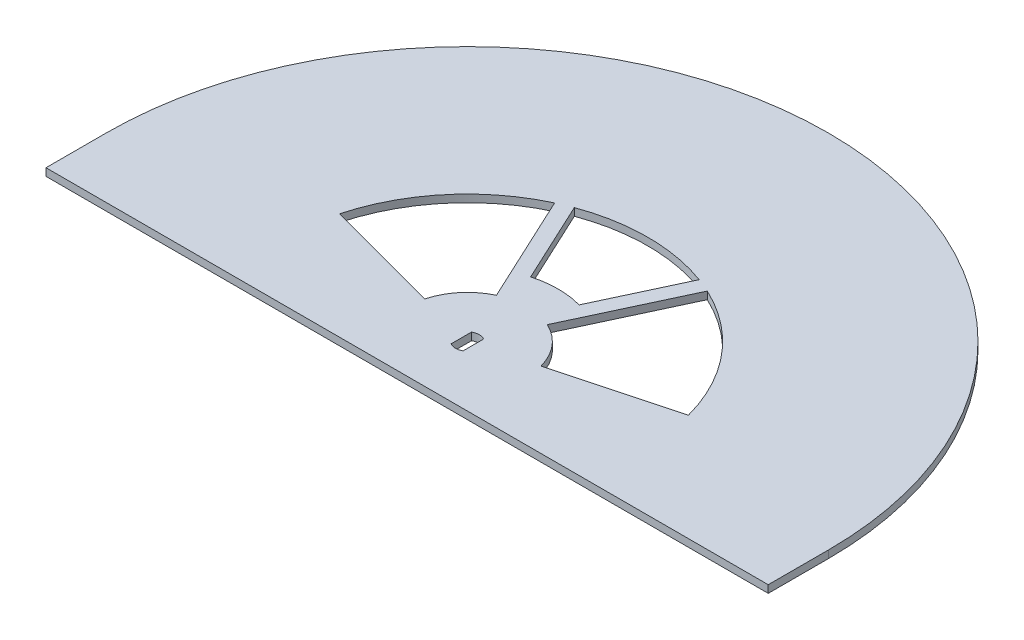
ISO-10303-21;
HEADER;
FILE_DESCRIPTION(('STEP AP214'),'2;1');
FILE_NAME('part.step','',(''),(''),'','','');
FILE_SCHEMA(('AUTOMOTIVE_DESIGN { 1 0 10303 214 1 1 1 1 }'));
ENDSEC;
DATA;
#1=APPLICATION_CONTEXT('core data for automotive mechanical design processes');
#2=APPLICATION_PROTOCOL_DEFINITION('international standard','automotive_design',2000,#1);
#3=PRODUCT_CONTEXT('',#1,'mechanical');
#4=PRODUCT('Part','Part','',(#3));
#5=PRODUCT_RELATED_PRODUCT_CATEGORY('part','',(#4));
#6=PRODUCT_DEFINITION_FORMATION('','',#4);
#7=PRODUCT_DEFINITION_CONTEXT('part definition',#1,'design');
#8=PRODUCT_DEFINITION('design','',#6,#7);
#9=PRODUCT_DEFINITION_SHAPE('','',#8);
#10=(LENGTH_UNIT() NAMED_UNIT(*) SI_UNIT(.MILLI.,.METRE.));
#11=(NAMED_UNIT(*) PLANE_ANGLE_UNIT() SI_UNIT($,.RADIAN.));
#12=(NAMED_UNIT(*) SI_UNIT($,.STERADIAN.) SOLID_ANGLE_UNIT());
#13=UNCERTAINTY_MEASURE_WITH_UNIT(LENGTH_MEASURE(1.E-05),#10,'distance_accuracy_value','');
#14=(GEOMETRIC_REPRESENTATION_CONTEXT(3) GLOBAL_UNCERTAINTY_ASSIGNED_CONTEXT((#13)) GLOBAL_UNIT_ASSIGNED_CONTEXT((#10,
#11,#12)) REPRESENTATION_CONTEXT('',''));
#15=CARTESIAN_POINT('',(0.,0.,0.));
#16=DIRECTION('',(0.,0.,1.));
#17=DIRECTION('',(1.,0.,0.));
#18=AXIS2_PLACEMENT_3D('',#15,#16,#17);
#19=CARTESIAN_POINT('',(0.,1.5875,0.));
#20=DIRECTION('',(0.,1.,0.));
#21=DIRECTION('',(0.,0.,1.));
#22=AXIS2_PLACEMENT_3D('',#19,#20,#21);
#23=PLANE('',#22);
#24=CARTESIAN_POINT('',(0.,1.5875,0.));
#25=DIRECTION('',(0.,1.,0.));
#26=DIRECTION('',(0.,0.,1.));
#27=AXIS2_PLACEMENT_3D('',#24,#25,#26);
#28=CIRCLE('',#27,2.5);
#29=CARTESIAN_POINT('',(1.27573508221731,1.5875,-2.15));
#30=VERTEX_POINT('',#29);
#31=CARTESIAN_POINT('',(-1.27573508221731,1.5875,-2.15));
#32=VERTEX_POINT('',#31);
#33=EDGE_CURVE('E50',#30,#32,#28,.T.);
#34=ORIENTED_EDGE('',*,*,#33,.F.);
#35=DIRECTION('',(0.,0.,-1.));
#36=VECTOR('',#35,1.);
#37=CARTESIAN_POINT('',(1.27573508221731,1.5875,-2.15));
#38=LINE('',#37,#36);
#39=CARTESIAN_POINT('',(1.27573508221731,1.5875,2.15));
#40=VERTEX_POINT('',#39);
#41=EDGE_CURVE('E189',#40,#30,#38,.T.);
#42=ORIENTED_EDGE('',*,*,#41,.F.);
#43=CARTESIAN_POINT('',(0.,1.5875,0.));
#44=DIRECTION('',(0.,1.,0.));
#45=DIRECTION('',(0.,0.,1.));
#46=AXIS2_PLACEMENT_3D('',#43,#44,#45);
#47=CIRCLE('',#46,2.5);
#48=CARTESIAN_POINT('',(-1.27573508221731,1.5875,2.15));
#49=VERTEX_POINT('',#48);
#50=EDGE_CURVE('E192',#49,#40,#47,.T.);
#51=ORIENTED_EDGE('',*,*,#50,.F.);
#52=DIRECTION('',(0.,0.,1.));
#53=VECTOR('',#52,1.);
#54=CARTESIAN_POINT('',(-1.27573508221731,1.5875,-2.15));
#55=LINE('',#54,#53);
#56=EDGE_CURVE('E198',#32,#49,#55,.T.);
#57=ORIENTED_EDGE('',*,*,#56,.F.);
#58=EDGE_LOOP('',(#34,#42,#51,#57));
#59=FACE_BOUND('',#58,.T.);
#60=CARTESIAN_POINT('',(0.,1.5875,0.));
#61=DIRECTION('',(0.,1.,0.));
#62=DIRECTION('',(0.,0.,1.));
#63=AXIS2_PLACEMENT_3D('',#60,#61,#62);
#64=CIRCLE('',#63,76.2);
#65=CARTESIAN_POINT('',(76.2,1.5875,0.));
#66=VERTEX_POINT('',#65);
#67=CARTESIAN_POINT('',(-76.2,1.5875,0.));
#68=VERTEX_POINT('',#67);
#69=EDGE_CURVE('E321',#66,#68,#64,.T.);
#70=ORIENTED_EDGE('',*,*,#69,.T.);
#71=DIRECTION('',(0.,0.,1.));
#72=VECTOR('',#71,1.);
#73=CARTESIAN_POINT('',(-76.2,1.5875,0.));
#74=LINE('',#73,#72);
#75=CARTESIAN_POINT('',(-76.2,1.5875,12.7));
#76=VERTEX_POINT('',#75);
#77=EDGE_CURVE('E204',#68,#76,#74,.T.);
#78=ORIENTED_EDGE('',*,*,#77,.T.);
#79=DIRECTION('',(1.,0.,0.));
#80=VECTOR('',#79,1.);
#81=CARTESIAN_POINT('',(-76.2,1.5875,12.7));
#82=LINE('',#81,#80);
#83=CARTESIAN_POINT('',(76.2,1.5875,12.7));
#84=VERTEX_POINT('',#83);
#85=EDGE_CURVE('E220',#76,#84,#82,.T.);
#86=ORIENTED_EDGE('',*,*,#85,.T.);
#87=DIRECTION('',(0.,0.,-1.));
#88=VECTOR('',#87,1.);
#89=CARTESIAN_POINT('',(76.2,1.5875,0.));
#90=LINE('',#89,#88);
#91=EDGE_CURVE('E212',#84,#66,#90,.T.);
#92=ORIENTED_EDGE('',*,*,#91,.T.);
#93=EDGE_LOOP('',(#70,#78,#86,#92));
#94=FACE_BOUND('',#93,.T.);
#95=DIRECTION('',(-0.422618261743583,0.,-0.906307787035306));
#96=VECTOR('',#95,1.);
#97=CARTESIAN_POINT('',(-16.1017557724588,1.5875,-34.5303266860319));
#98=LINE('',#97,#96);
#99=CARTESIAN_POINT('',(-5.36725192413684,1.5875,-11.5101088952602));
#100=VERTEX_POINT('',#99);
#101=CARTESIAN_POINT('',(-16.1017557724588,1.5875,-34.5303266860319));
#102=VERTEX_POINT('',#101);
#103=EDGE_CURVE('E292',#100,#102,#98,.T.);
#104=ORIENTED_EDGE('',*,*,#103,.F.);
#105=CARTESIAN_POINT('',(0.,1.5875,0.));
#106=DIRECTION('',(0.,-1.,0.));
#107=DIRECTION('',(0.,0.,-1.));
#108=AXIS2_PLACEMENT_3D('',#105,#106,#107);
#109=CIRCLE('',#108,12.699999999901);
#110=CARTESIAN_POINT('',(-12.2672579937825,1.5875,-3.28700187268744));
#111=VERTEX_POINT('',#110);
#112=EDGE_CURVE('E290',#111,#100,#109,.T.);
#113=ORIENTED_EDGE('',*,*,#112,.F.);
#114=DIRECTION('',(0.965925826289434,0.,0.258819045101154));
#115=VECTOR('',#114,1.);
#116=CARTESIAN_POINT('',(-12.2672579937825,1.5875,-3.28700187268744));
#117=LINE('',#116,#115);
#118=CARTESIAN_POINT('',(-36.8017739816455,1.5875,-9.8610056182866));
#119=VERTEX_POINT('',#118);
#120=EDGE_CURVE('E298',#119,#111,#117,.T.);
#121=ORIENTED_EDGE('',*,*,#120,.F.);
#122=CARTESIAN_POINT('',(0.,1.5875,0.));
#123=DIRECTION('',(0.,1.,0.));
#124=DIRECTION('',(0.,0.,-1.));
#125=AXIS2_PLACEMENT_3D('',#122,#123,#124);
#126=CIRCLE('',#125,38.1);
#127=EDGE_CURVE('E295',#102,#119,#126,.T.);
#128=ORIENTED_EDGE('',*,*,#127,.F.);
#129=EDGE_LOOP('',(#104,#113,#121,#128));
#130=FACE_BOUND('',#129,.T.);
#131=DIRECTION('',(0.422618261743582,0.,0.906307787035306));
#132=VECTOR('',#131,1.);
#133=CARTESIAN_POINT('',(-13.1682222718977,1.5875,-35.7520338190421));
#134=LINE('',#133,#132);
#135=CARTESIAN_POINT('',(-13.1682222718977,1.5875,-35.7520338190421));
#136=VERTEX_POINT('',#135);
#137=CARTESIAN_POINT('',(-5.11734438568244,1.5875,-18.4868704760196));
#138=VERTEX_POINT('',#137);
#139=EDGE_CURVE('E261',#136,#138,#134,.T.);
#140=ORIENTED_EDGE('',*,*,#139,.F.);
#141=CARTESIAN_POINT('',(-3.84946970807113E-11,1.5875,-8.25571218872692E-11));
#142=DIRECTION('',(0.,1.,0.));
#143=DIRECTION('',(0.,0.,-1.));
#144=AXIS2_PLACEMENT_3D('',#141,#142,#143);
#145=CIRCLE('',#144,38.0999999999097);
#146=CARTESIAN_POINT('',(13.1682222716843,1.5875,-35.7520338190923));
#147=VERTEX_POINT('',#146);
#148=EDGE_CURVE('E259',#147,#136,#145,.T.);
#149=ORIENTED_EDGE('',*,*,#148,.F.);
#150=DIRECTION('',(0.422618261739206,0.,-0.906307787037346));
#151=VECTOR('',#150,1.);
#152=CARTESIAN_POINT('',(13.1682222716843,1.5875,-35.7520338190923));
#153=LINE('',#152,#151);
#154=CARTESIAN_POINT('',(5.11734438556264,1.5875,-18.4868704760527));
#155=VERTEX_POINT('',#154);
#156=EDGE_CURVE('E267',#155,#147,#153,.T.);
#157=ORIENTED_EDGE('',*,*,#156,.F.);
#158=CARTESIAN_POINT('',(0.,1.5875,0.));
#159=DIRECTION('',(0.,-1.,0.));
#160=DIRECTION('',(0.,0.,-1.));
#161=AXIS2_PLACEMENT_3D('',#158,#159,#160);
#162=CIRCLE('',#161,19.1820643716676);
#163=EDGE_CURVE('E264',#138,#155,#162,.T.);
#164=ORIENTED_EDGE('',*,*,#163,.F.);
#165=EDGE_LOOP('',(#140,#149,#157,#164));
#166=FACE_BOUND('',#165,.T.);
#167=DIRECTION('',(0.965925826287314,0.,-0.258819045109067));
#168=VECTOR('',#167,1.);
#169=CARTESIAN_POINT('',(36.8017739815386,1.5875,-9.86100561868564));
#170=LINE('',#169,#168);
#171=CARTESIAN_POINT('',(12.2672579937609,1.5875,-3.28700187289392));
#172=VERTEX_POINT('',#171);
#173=CARTESIAN_POINT('',(36.8017739815386,1.5875,-9.86100561868565));
#174=VERTEX_POINT('',#173);
#175=EDGE_CURVE('E230',#172,#174,#170,.T.);
#176=ORIENTED_EDGE('',*,*,#175,.F.);
#177=CARTESIAN_POINT('',(0.,1.5875,0.));
#178=DIRECTION('',(0.,-1.,0.));
#179=DIRECTION('',(0.,0.,-1.));
#180=AXIS2_PLACEMENT_3D('',#177,#178,#179);
#181=CIRCLE('',#180,12.699999999901);
#182=CARTESIAN_POINT('',(5.36725192393726,1.5875,-11.5101088953173));
#183=VERTEX_POINT('',#182);
#184=EDGE_CURVE('E228',#183,#172,#181,.T.);
#185=ORIENTED_EDGE('',*,*,#184,.F.);
#186=DIRECTION('',(-0.422618261736158,0.,0.906307787038768));
#187=VECTOR('',#186,1.);
#188=CARTESIAN_POINT('',(5.36725192393726,1.5875,-11.5101088953173));
#189=LINE('',#188,#187);
#190=CARTESIAN_POINT('',(16.1017557720844,1.5875,-34.5303266862065));
#191=VERTEX_POINT('',#190);
#192=EDGE_CURVE('E236',#191,#183,#189,.T.);
#193=ORIENTED_EDGE('',*,*,#192,.F.);
#194=CARTESIAN_POINT('',(0.,1.5875,0.));
#195=DIRECTION('',(0.,1.,0.));
#196=DIRECTION('',(0.,0.,-1.));
#197=AXIS2_PLACEMENT_3D('',#194,#195,#196);
#198=CIRCLE('',#197,38.1);
#199=EDGE_CURVE('E233',#174,#191,#198,.T.);
#200=ORIENTED_EDGE('',*,*,#199,.F.);
#201=EDGE_LOOP('',(#176,#185,#193,#200));
#202=FACE_BOUND('',#201,.T.);
#203=ADVANCED_FACE('F35',(#59,#94,#130,#166,#202),#23,.T.);
#204=CARTESIAN_POINT('',(0.,0.,0.));
#205=DIRECTION('',(0.,1.,0.));
#206=DIRECTION('',(0.,0.,1.));
#207=AXIS2_PLACEMENT_3D('',#204,#205,#206);
#208=PLANE('',#207);
#209=DIRECTION('',(0.,0.,-1.));
#210=VECTOR('',#209,1.);
#211=CARTESIAN_POINT('',(1.27573508221731,0.,-2.15));
#212=LINE('',#211,#210);
#213=CARTESIAN_POINT('',(1.27573508221731,0.,2.15));
#214=VERTEX_POINT('',#213);
#215=CARTESIAN_POINT('',(1.27573508221731,0.,-2.15));
#216=VERTEX_POINT('',#215);
#217=EDGE_CURVE('E179',#214,#216,#212,.T.);
#218=ORIENTED_EDGE('',*,*,#217,.T.);
#219=CARTESIAN_POINT('',(0.,0.,0.));
#220=DIRECTION('',(0.,1.,0.));
#221=DIRECTION('',(0.,0.,1.));
#222=AXIS2_PLACEMENT_3D('',#219,#220,#221);
#223=CIRCLE('',#222,2.5);
#224=CARTESIAN_POINT('',(-1.27573508221731,0.,-2.15));
#225=VERTEX_POINT('',#224);
#226=EDGE_CURVE('E173',#216,#225,#223,.T.);
#227=ORIENTED_EDGE('',*,*,#226,.T.);
#228=DIRECTION('',(0.,0.,1.));
#229=VECTOR('',#228,1.);
#230=CARTESIAN_POINT('',(-1.27573508221731,0.,-2.15));
#231=LINE('',#230,#229);
#232=CARTESIAN_POINT('',(-1.27573508221731,0.,2.15));
#233=VERTEX_POINT('',#232);
#234=EDGE_CURVE('E182',#225,#233,#231,.T.);
#235=ORIENTED_EDGE('',*,*,#234,.T.);
#236=CARTESIAN_POINT('',(0.,0.,0.));
#237=DIRECTION('',(0.,1.,0.));
#238=DIRECTION('',(0.,0.,1.));
#239=AXIS2_PLACEMENT_3D('',#236,#237,#238);
#240=CIRCLE('',#239,2.5);
#241=EDGE_CURVE('E58',#233,#214,#240,.T.);
#242=ORIENTED_EDGE('',*,*,#241,.T.);
#243=EDGE_LOOP('',(#218,#227,#235,#242));
#244=FACE_BOUND('',#243,.T.);
#245=CARTESIAN_POINT('',(-3.84946970807113E-11,0.,-8.25571218872692E-11));
#246=DIRECTION('',(0.,1.,0.));
#247=DIRECTION('',(0.,0.,-1.));
#248=AXIS2_PLACEMENT_3D('',#245,#246,#247);
#249=CIRCLE('',#248,38.0999999999097);
#250=CARTESIAN_POINT('',(13.1682222716843,0.,-35.7520338190923));
#251=VERTEX_POINT('',#250);
#252=CARTESIAN_POINT('',(-13.1682222718977,0.,-35.7520338190421));
#253=VERTEX_POINT('',#252);
#254=EDGE_CURVE('E258',#251,#253,#249,.T.);
#255=ORIENTED_EDGE('',*,*,#254,.T.);
#256=DIRECTION('',(0.422618261743582,0.,0.906307787035306));
#257=VECTOR('',#256,1.);
#258=CARTESIAN_POINT('',(-13.1682222718977,0.,-35.7520338190421));
#259=LINE('',#258,#257);
#260=CARTESIAN_POINT('',(-5.11734438568244,0.,-18.4868704760196));
#261=VERTEX_POINT('',#260);
#262=EDGE_CURVE('E272',#253,#261,#259,.T.);
#263=ORIENTED_EDGE('',*,*,#262,.T.);
#264=CARTESIAN_POINT('',(0.,0.,0.));
#265=DIRECTION('',(0.,-1.,0.));
#266=DIRECTION('',(0.,0.,-1.));
#267=AXIS2_PLACEMENT_3D('',#264,#265,#266);
#268=CIRCLE('',#267,19.1820643716676);
#269=CARTESIAN_POINT('',(5.11734438556265,0.,-18.4868704760527));
#270=VERTEX_POINT('',#269);
#271=EDGE_CURVE('E275',#261,#270,#268,.T.);
#272=ORIENTED_EDGE('',*,*,#271,.T.);
#273=DIRECTION('',(0.422618261739206,0.,-0.906307787037346));
#274=VECTOR('',#273,1.);
#275=CARTESIAN_POINT('',(13.1682222716843,0.,-35.7520338190923));
#276=LINE('',#275,#274);
#277=EDGE_CURVE('E262',#270,#251,#276,.T.);
#278=ORIENTED_EDGE('',*,*,#277,.T.);
#279=EDGE_LOOP('',(#255,#263,#272,#278));
#280=FACE_BOUND('',#279,.T.);
#281=CARTESIAN_POINT('',(0.,0.,0.));
#282=DIRECTION('',(0.,1.,0.));
#283=DIRECTION('',(0.,0.,1.));
#284=AXIS2_PLACEMENT_3D('',#281,#282,#283);
#285=CIRCLE('',#284,76.2);
#286=CARTESIAN_POINT('',(76.2,0.,0.));
#287=VERTEX_POINT('',#286);
#288=CARTESIAN_POINT('',(-76.2,0.,0.));
#289=VERTEX_POINT('',#288);
#290=EDGE_CURVE('E320',#287,#289,#285,.T.);
#291=ORIENTED_EDGE('',*,*,#290,.F.);
#292=DIRECTION('',(0.,0.,-1.));
#293=VECTOR('',#292,1.);
#294=CARTESIAN_POINT('',(76.2,0.,0.));
#295=LINE('',#294,#293);
#296=CARTESIAN_POINT('',(76.2,0.,12.7));
#297=VERTEX_POINT('',#296);
#298=EDGE_CURVE('E215',#297,#287,#295,.T.);
#299=ORIENTED_EDGE('',*,*,#298,.F.);
#300=DIRECTION('',(1.,0.,0.));
#301=VECTOR('',#300,1.);
#302=CARTESIAN_POINT('',(-76.2,0.,12.7));
#303=LINE('',#302,#301);
#304=CARTESIAN_POINT('',(-76.2,0.,12.7));
#305=VERTEX_POINT('',#304);
#306=EDGE_CURVE('E211',#305,#297,#303,.T.);
#307=ORIENTED_EDGE('',*,*,#306,.F.);
#308=DIRECTION('',(0.,0.,1.));
#309=VECTOR('',#308,1.);
#310=CARTESIAN_POINT('',(-76.2,0.,0.));
#311=LINE('',#310,#309);
#312=EDGE_CURVE('E208',#289,#305,#311,.T.);
#313=ORIENTED_EDGE('',*,*,#312,.F.);
#314=EDGE_LOOP('',(#291,#299,#307,#313));
#315=FACE_BOUND('',#314,.T.);
#316=CARTESIAN_POINT('',(0.,0.,0.));
#317=DIRECTION('',(0.,-1.,0.));
#318=DIRECTION('',(0.,0.,-1.));
#319=AXIS2_PLACEMENT_3D('',#316,#317,#318);
#320=CIRCLE('',#319,12.699999999901);
#321=CARTESIAN_POINT('',(-12.2672579937825,0.,-3.28700187268744));
#322=VERTEX_POINT('',#321);
#323=CARTESIAN_POINT('',(-5.36725192413684,0.,-11.5101088952602));
#324=VERTEX_POINT('',#323);
#325=EDGE_CURVE('E289',#322,#324,#320,.T.);
#326=ORIENTED_EDGE('',*,*,#325,.T.);
#327=DIRECTION('',(-0.422618261743583,0.,-0.906307787035306));
#328=VECTOR('',#327,1.);
#329=CARTESIAN_POINT('',(-16.1017557724588,0.,-34.5303266860319));
#330=LINE('',#329,#328);
#331=CARTESIAN_POINT('',(-16.1017557724588,0.,-34.5303266860319));
#332=VERTEX_POINT('',#331);
#333=EDGE_CURVE('E303',#324,#332,#330,.T.);
#334=ORIENTED_EDGE('',*,*,#333,.T.);
#335=CARTESIAN_POINT('',(0.,0.,0.));
#336=DIRECTION('',(0.,1.,0.));
#337=DIRECTION('',(0.,0.,-1.));
#338=AXIS2_PLACEMENT_3D('',#335,#336,#337);
#339=CIRCLE('',#338,38.1);
#340=CARTESIAN_POINT('',(-36.8017739816455,0.,-9.8610056182866));
#341=VERTEX_POINT('',#340);
#342=EDGE_CURVE('E306',#332,#341,#339,.T.);
#343=ORIENTED_EDGE('',*,*,#342,.T.);
#344=DIRECTION('',(0.965925826289434,0.,0.258819045101154));
#345=VECTOR('',#344,1.);
#346=CARTESIAN_POINT('',(-12.2672579937825,0.,-3.28700187268744));
#347=LINE('',#346,#345);
#348=EDGE_CURVE('E293',#341,#322,#347,.T.);
#349=ORIENTED_EDGE('',*,*,#348,.T.);
#350=EDGE_LOOP('',(#326,#334,#343,#349));
#351=FACE_BOUND('',#350,.T.);
#352=CARTESIAN_POINT('',(0.,0.,0.));
#353=DIRECTION('',(0.,-1.,0.));
#354=DIRECTION('',(0.,0.,-1.));
#355=AXIS2_PLACEMENT_3D('',#352,#353,#354);
#356=CIRCLE('',#355,12.699999999901);
#357=CARTESIAN_POINT('',(5.36725192393726,0.,-11.5101088953173));
#358=VERTEX_POINT('',#357);
#359=CARTESIAN_POINT('',(12.2672579937609,0.,-3.28700187289392));
#360=VERTEX_POINT('',#359);
#361=EDGE_CURVE('E226',#358,#360,#356,.T.);
#362=ORIENTED_EDGE('',*,*,#361,.T.);
#363=DIRECTION('',(0.965925826287314,0.,-0.258819045109067));
#364=VECTOR('',#363,1.);
#365=CARTESIAN_POINT('',(36.8017739815386,0.,-9.86100561868564));
#366=LINE('',#365,#364);
#367=CARTESIAN_POINT('',(36.8017739815386,0.,-9.86100561868565));
#368=VERTEX_POINT('',#367);
#369=EDGE_CURVE('E241',#360,#368,#366,.T.);
#370=ORIENTED_EDGE('',*,*,#369,.T.);
#371=CARTESIAN_POINT('',(0.,0.,0.));
#372=DIRECTION('',(0.,1.,0.));
#373=DIRECTION('',(0.,0.,-1.));
#374=AXIS2_PLACEMENT_3D('',#371,#372,#373);
#375=CIRCLE('',#374,38.1);
#376=CARTESIAN_POINT('',(16.1017557720844,0.,-34.5303266862065));
#377=VERTEX_POINT('',#376);
#378=EDGE_CURVE('E244',#368,#377,#375,.T.);
#379=ORIENTED_EDGE('',*,*,#378,.T.);
#380=DIRECTION('',(-0.422618261736158,0.,0.906307787038768));
#381=VECTOR('',#380,1.);
#382=CARTESIAN_POINT('',(5.36725192393726,0.,-11.5101088953173));
#383=LINE('',#382,#381);
#384=EDGE_CURVE('E231',#377,#358,#383,.T.);
#385=ORIENTED_EDGE('',*,*,#384,.T.);
#386=EDGE_LOOP('',(#362,#370,#379,#385));
#387=FACE_BOUND('',#386,.T.);
#388=ADVANCED_FACE('F186',(#244,#280,#315,#351,#387),#208,.F.);
#389=CARTESIAN_POINT('',(0.,1.5875,0.));
#390=DIRECTION('',(0.,-1.,0.));
#391=DIRECTION('',(0.,0.,-1.));
#392=AXIS2_PLACEMENT_3D('',#389,#390,#391);
#393=CYLINDRICAL_SURFACE('',#392,76.2);
#394=ORIENTED_EDGE('',*,*,#290,.T.);
#395=DIRECTION('',(0.,-1.,0.));
#396=VECTOR('',#395,1.);
#397=CARTESIAN_POINT('',(-76.2,1.5875,0.));
#398=LINE('',#397,#396);
#399=EDGE_CURVE('E11',#68,#289,#398,.T.);
#400=ORIENTED_EDGE('',*,*,#399,.F.);
#401=ORIENTED_EDGE('',*,*,#69,.F.);
#402=DIRECTION('',(0.,-1.,0.));
#403=VECTOR('',#402,1.);
#404=CARTESIAN_POINT('',(76.2,1.5875,0.));
#405=LINE('',#404,#403);
#406=EDGE_CURVE('E43',#66,#287,#405,.T.);
#407=ORIENTED_EDGE('',*,*,#406,.T.);
#408=EDGE_LOOP('',(#394,#400,#401,#407));
#409=FACE_BOUND('',#408,.T.);
#410=ADVANCED_FACE('F37',(#409),#393,.T.);
#411=CARTESIAN_POINT('',(0.,1.5875,0.));
#412=DIRECTION('',(0.,-1.,0.));
#413=DIRECTION('',(0.,0.,-1.));
#414=AXIS2_PLACEMENT_3D('',#411,#412,#413);
#415=CYLINDRICAL_SURFACE('',#414,12.699999999901);
#416=ORIENTED_EDGE('',*,*,#325,.F.);
#417=DIRECTION('',(0.,-1.,0.));
#418=VECTOR('',#417,1.);
#419=CARTESIAN_POINT('',(-12.2672579937825,1.5875,-3.28700187268744));
#420=LINE('',#419,#418);
#421=EDGE_CURVE('E300',#111,#322,#420,.T.);
#422=ORIENTED_EDGE('',*,*,#421,.F.);
#423=ORIENTED_EDGE('',*,*,#112,.T.);
#424=DIRECTION('',(0.,-1.,0.));
#425=VECTOR('',#424,1.);
#426=CARTESIAN_POINT('',(-5.36725192413684,1.5875,-11.5101088952602));
#427=LINE('',#426,#425);
#428=EDGE_CURVE('E317',#100,#324,#427,.T.);
#429=ORIENTED_EDGE('',*,*,#428,.T.);
#430=EDGE_LOOP('',(#416,#422,#423,#429));
#431=FACE_BOUND('',#430,.T.);
#432=ADVANCED_FACE('F363',(#431),#415,.T.);
#433=CARTESIAN_POINT('',(-16.1017557724588,1.5875,-34.5303266860319));
#434=DIRECTION('',(-0.906307787035305,0.,0.422618261743583));
#435=DIRECTION('',(0.422618261743583,0.,0.906307787035306));
#436=AXIS2_PLACEMENT_3D('',#433,#434,#435);
#437=PLANE('',#436);
#438=ORIENTED_EDGE('',*,*,#333,.F.);
#439=ORIENTED_EDGE('',*,*,#428,.F.);
#440=ORIENTED_EDGE('',*,*,#103,.T.);
#441=DIRECTION('',(0.,-1.,0.));
#442=VECTOR('',#441,1.);
#443=CARTESIAN_POINT('',(-16.1017557724588,1.5875,-34.5303266860319));
#444=LINE('',#443,#442);
#445=EDGE_CURVE('E315',#102,#332,#444,.T.);
#446=ORIENTED_EDGE('',*,*,#445,.T.);
#447=EDGE_LOOP('',(#438,#439,#440,#446));
#448=FACE_BOUND('',#447,.T.);
#449=ADVANCED_FACE('F366',(#448),#437,.T.);
#450=CARTESIAN_POINT('',(0.,1.5875,0.));
#451=DIRECTION('',(0.,-1.,0.));
#452=DIRECTION('',(0.,0.,-1.));
#453=AXIS2_PLACEMENT_3D('',#450,#451,#452);
#454=CYLINDRICAL_SURFACE('',#453,38.1);
#455=ORIENTED_EDGE('',*,*,#342,.F.);
#456=ORIENTED_EDGE('',*,*,#445,.F.);
#457=ORIENTED_EDGE('',*,*,#127,.T.);
#458=DIRECTION('',(0.,-1.,0.));
#459=VECTOR('',#458,1.);
#460=CARTESIAN_POINT('',(-36.8017739816455,1.5875,-9.8610056182866));
#461=LINE('',#460,#459);
#462=EDGE_CURVE('E313',#119,#341,#461,.T.);
#463=ORIENTED_EDGE('',*,*,#462,.T.);
#464=EDGE_LOOP('',(#455,#456,#457,#463));
#465=FACE_BOUND('',#464,.T.);
#466=ADVANCED_FACE('F370',(#465),#454,.F.);
#467=CARTESIAN_POINT('',(-12.2672579937825,1.5875,-3.28700187268744));
#468=DIRECTION('',(0.258819045101154,0.,-0.965925826289434));
#469=DIRECTION('',(-0.965925826289434,0.,-0.258819045101154));
#470=AXIS2_PLACEMENT_3D('',#467,#468,#469);
#471=PLANE('',#470);
#472=ORIENTED_EDGE('',*,*,#348,.F.);
#473=ORIENTED_EDGE('',*,*,#462,.F.);
#474=ORIENTED_EDGE('',*,*,#120,.T.);
#475=ORIENTED_EDGE('',*,*,#421,.T.);
#476=EDGE_LOOP('',(#472,#473,#474,#475));
#477=FACE_BOUND('',#476,.T.);
#478=ADVANCED_FACE('F374',(#477),#471,.T.);
#479=CARTESIAN_POINT('',(-3.84946970807113E-11,1.5875,-8.25571218872692E-11));
#480=DIRECTION('',(0.,-1.,0.));
#481=DIRECTION('',(0.,0.,-1.));
#482=AXIS2_PLACEMENT_3D('',#479,#480,#481);
#483=CYLINDRICAL_SURFACE('',#482,38.0999999999097);
#484=ORIENTED_EDGE('',*,*,#254,.F.);
#485=DIRECTION('',(0.,-1.,0.));
#486=VECTOR('',#485,1.);
#487=CARTESIAN_POINT('',(13.1682222716843,1.5875,-35.7520338190923));
#488=LINE('',#487,#486);
#489=EDGE_CURVE('E269',#147,#251,#488,.T.);
#490=ORIENTED_EDGE('',*,*,#489,.F.);
#491=ORIENTED_EDGE('',*,*,#148,.T.);
#492=DIRECTION('',(0.,-1.,0.));
#493=VECTOR('',#492,1.);
#494=CARTESIAN_POINT('',(-13.1682222718977,1.5875,-35.7520338190421));
#495=LINE('',#494,#493);
#496=EDGE_CURVE('E286',#136,#253,#495,.T.);
#497=ORIENTED_EDGE('',*,*,#496,.T.);
#498=EDGE_LOOP('',(#484,#490,#491,#497));
#499=FACE_BOUND('',#498,.T.);
#500=ADVANCED_FACE('F378',(#499),#483,.F.);
#501=CARTESIAN_POINT('',(-13.1682222718977,1.5875,-35.7520338190421));
#502=DIRECTION('',(0.906307787035306,0.,-0.422618261743582));
#503=DIRECTION('',(-0.422618261743582,0.,-0.906307787035306));
#504=AXIS2_PLACEMENT_3D('',#501,#502,#503);
#505=PLANE('',#504);
#506=ORIENTED_EDGE('',*,*,#262,.F.);
#507=ORIENTED_EDGE('',*,*,#496,.F.);
#508=ORIENTED_EDGE('',*,*,#139,.T.);
#509=DIRECTION('',(0.,-1.,0.));
#510=VECTOR('',#509,1.);
#511=CARTESIAN_POINT('',(-5.11734438568244,1.5875,-18.4868704760196));
#512=LINE('',#511,#510);
#513=EDGE_CURVE('E284',#138,#261,#512,.T.);
#514=ORIENTED_EDGE('',*,*,#513,.T.);
#515=EDGE_LOOP('',(#506,#507,#508,#514));
#516=FACE_BOUND('',#515,.T.);
#517=ADVANCED_FACE('F382',(#516),#505,.T.);
#518=CARTESIAN_POINT('',(0.,1.5875,0.));
#519=DIRECTION('',(0.,-1.,0.));
#520=DIRECTION('',(0.,0.,-1.));
#521=AXIS2_PLACEMENT_3D('',#518,#519,#520);
#522=CYLINDRICAL_SURFACE('',#521,19.1820643716676);
#523=ORIENTED_EDGE('',*,*,#271,.F.);
#524=ORIENTED_EDGE('',*,*,#513,.F.);
#525=ORIENTED_EDGE('',*,*,#163,.T.);
#526=DIRECTION('',(0.,-1.,0.));
#527=VECTOR('',#526,1.);
#528=CARTESIAN_POINT('',(5.11734438556265,1.5875,-18.4868704760527));
#529=LINE('',#528,#527);
#530=EDGE_CURVE('E282',#155,#270,#529,.T.);
#531=ORIENTED_EDGE('',*,*,#530,.T.);
#532=EDGE_LOOP('',(#523,#524,#525,#531));
#533=FACE_BOUND('',#532,.T.);
#534=ADVANCED_FACE('F386',(#533),#522,.T.);
#535=CARTESIAN_POINT('',(13.1682222716843,1.5875,-35.7520338190923));
#536=DIRECTION('',(-0.906307787037346,0.,-0.422618261739206));
#537=DIRECTION('',(-0.422618261739206,0.,0.906307787037346));
#538=AXIS2_PLACEMENT_3D('',#535,#536,#537);
#539=PLANE('',#538);
#540=ORIENTED_EDGE('',*,*,#277,.F.);
#541=ORIENTED_EDGE('',*,*,#530,.F.);
#542=ORIENTED_EDGE('',*,*,#156,.T.);
#543=ORIENTED_EDGE('',*,*,#489,.T.);
#544=EDGE_LOOP('',(#540,#541,#542,#543));
#545=FACE_BOUND('',#544,.T.);
#546=ADVANCED_FACE('F390',(#545),#539,.T.);
#547=CARTESIAN_POINT('',(0.,1.5875,0.));
#548=DIRECTION('',(0.,-1.,0.));
#549=DIRECTION('',(0.,0.,-1.));
#550=AXIS2_PLACEMENT_3D('',#547,#548,#549);
#551=CYLINDRICAL_SURFACE('',#550,12.699999999901);
#552=ORIENTED_EDGE('',*,*,#361,.F.);
#553=DIRECTION('',(0.,-1.,0.));
#554=VECTOR('',#553,1.);
#555=CARTESIAN_POINT('',(5.36725192393726,1.5875,-11.5101088953173));
#556=LINE('',#555,#554);
#557=EDGE_CURVE('E238',#183,#358,#556,.T.);
#558=ORIENTED_EDGE('',*,*,#557,.F.);
#559=ORIENTED_EDGE('',*,*,#184,.T.);
#560=DIRECTION('',(0.,-1.,0.));
#561=VECTOR('',#560,1.);
#562=CARTESIAN_POINT('',(12.2672579937609,1.5875,-3.28700187289392));
#563=LINE('',#562,#561);
#564=EDGE_CURVE('E255',#172,#360,#563,.T.);
#565=ORIENTED_EDGE('',*,*,#564,.T.);
#566=EDGE_LOOP('',(#552,#558,#559,#565));
#567=FACE_BOUND('',#566,.T.);
#568=ADVANCED_FACE('F394',(#567),#551,.T.);
#569=CARTESIAN_POINT('',(36.8017739815386,1.5875,-9.86100561868564));
#570=DIRECTION('',(-0.258819045109067,0.,-0.965925826287314));
#571=DIRECTION('',(-0.965925826287314,0.,0.258819045109067));
#572=AXIS2_PLACEMENT_3D('',#569,#570,#571);
#573=PLANE('',#572);
#574=ORIENTED_EDGE('',*,*,#369,.F.);
#575=ORIENTED_EDGE('',*,*,#564,.F.);
#576=ORIENTED_EDGE('',*,*,#175,.T.);
#577=DIRECTION('',(0.,-1.,0.));
#578=VECTOR('',#577,1.);
#579=CARTESIAN_POINT('',(36.8017739815386,1.5875,-9.86100561868565));
#580=LINE('',#579,#578);
#581=EDGE_CURVE('E253',#174,#368,#580,.T.);
#582=ORIENTED_EDGE('',*,*,#581,.T.);
#583=EDGE_LOOP('',(#574,#575,#576,#582));
#584=FACE_BOUND('',#583,.T.);
#585=ADVANCED_FACE('F398',(#584),#573,.T.);
#586=CARTESIAN_POINT('',(0.,1.5875,0.));
#587=DIRECTION('',(0.,-1.,0.));
#588=DIRECTION('',(0.,0.,-1.));
#589=AXIS2_PLACEMENT_3D('',#586,#587,#588);
#590=CYLINDRICAL_SURFACE('',#589,38.1);
#591=ORIENTED_EDGE('',*,*,#378,.F.);
#592=ORIENTED_EDGE('',*,*,#581,.F.);
#593=ORIENTED_EDGE('',*,*,#199,.T.);
#594=DIRECTION('',(0.,-1.,0.));
#595=VECTOR('',#594,1.);
#596=CARTESIAN_POINT('',(16.1017557720844,1.5875,-34.5303266862065));
#597=LINE('',#596,#595);
#598=EDGE_CURVE('E251',#191,#377,#597,.T.);
#599=ORIENTED_EDGE('',*,*,#598,.T.);
#600=EDGE_LOOP('',(#591,#592,#593,#599));
#601=FACE_BOUND('',#600,.T.);
#602=ADVANCED_FACE('F402',(#601),#590,.F.);
#603=CARTESIAN_POINT('',(5.36725192393726,1.5875,-11.5101088953173));
#604=DIRECTION('',(0.906307787038768,0.,0.422618261736158));
#605=DIRECTION('',(0.422618261736158,0.,-0.906307787038768));
#606=AXIS2_PLACEMENT_3D('',#603,#604,#605);
#607=PLANE('',#606);
#608=ORIENTED_EDGE('',*,*,#384,.F.);
#609=ORIENTED_EDGE('',*,*,#598,.F.);
#610=ORIENTED_EDGE('',*,*,#192,.T.);
#611=ORIENTED_EDGE('',*,*,#557,.T.);
#612=EDGE_LOOP('',(#608,#609,#610,#611));
#613=FACE_BOUND('',#612,.T.);
#614=ADVANCED_FACE('F406',(#613),#607,.T.);
#615=CARTESIAN_POINT('',(-76.2,0.,0.));
#616=DIRECTION('',(-1.,0.,0.));
#617=DIRECTION('',(0.,0.,1.));
#618=AXIS2_PLACEMENT_3D('',#615,#616,#617);
#619=PLANE('',#618);
#620=ORIENTED_EDGE('',*,*,#77,.F.);
#621=ORIENTED_EDGE('',*,*,#399,.T.);
#622=ORIENTED_EDGE('',*,*,#312,.T.);
#623=DIRECTION('',(0.,1.,0.));
#624=VECTOR('',#623,1.);
#625=CARTESIAN_POINT('',(-76.2,0.,12.7));
#626=LINE('',#625,#624);
#627=EDGE_CURVE('E217',#305,#76,#626,.T.);
#628=ORIENTED_EDGE('',*,*,#627,.T.);
#629=EDGE_LOOP('',(#620,#621,#622,#628));
#630=FACE_BOUND('',#629,.T.);
#631=ADVANCED_FACE('F339',(#630),#619,.T.);
#632=CARTESIAN_POINT('',(76.2,0.,0.));
#633=DIRECTION('',(1.,0.,0.));
#634=DIRECTION('',(0.,0.,-1.));
#635=AXIS2_PLACEMENT_3D('',#632,#633,#634);
#636=PLANE('',#635);
#637=ORIENTED_EDGE('',*,*,#91,.F.);
#638=DIRECTION('',(0.,1.,0.));
#639=VECTOR('',#638,1.);
#640=CARTESIAN_POINT('',(76.2,0.,12.7));
#641=LINE('',#640,#639);
#642=EDGE_CURVE('E224',#297,#84,#641,.T.);
#643=ORIENTED_EDGE('',*,*,#642,.F.);
#644=ORIENTED_EDGE('',*,*,#298,.T.);
#645=ORIENTED_EDGE('',*,*,#406,.F.);
#646=EDGE_LOOP('',(#637,#643,#644,#645));
#647=FACE_BOUND('',#646,.T.);
#648=ADVANCED_FACE('F343',(#647),#636,.T.);
#649=CARTESIAN_POINT('',(-76.2,0.,12.7));
#650=DIRECTION('',(0.,0.,1.));
#651=DIRECTION('',(1.,0.,0.));
#652=AXIS2_PLACEMENT_3D('',#649,#650,#651);
#653=PLANE('',#652);
#654=ORIENTED_EDGE('',*,*,#85,.F.);
#655=ORIENTED_EDGE('',*,*,#627,.F.);
#656=ORIENTED_EDGE('',*,*,#306,.T.);
#657=ORIENTED_EDGE('',*,*,#642,.T.);
#658=EDGE_LOOP('',(#654,#655,#656,#657));
#659=FACE_BOUND('',#658,.T.);
#660=ADVANCED_FACE('F345',(#659),#653,.T.);
#661=CARTESIAN_POINT('',(0.,0.,0.));
#662=DIRECTION('',(0.,1.,0.));
#663=DIRECTION('',(0.,0.,1.));
#664=AXIS2_PLACEMENT_3D('',#661,#662,#663);
#665=CYLINDRICAL_SURFACE('',#664,2.5);
#666=ORIENTED_EDGE('',*,*,#33,.T.);
#667=DIRECTION('',(0.,1.,0.));
#668=VECTOR('',#667,1.);
#669=CARTESIAN_POINT('',(-1.27573508221731,0.,-2.15));
#670=LINE('',#669,#668);
#671=EDGE_CURVE('E169',#225,#32,#670,.T.);
#672=ORIENTED_EDGE('',*,*,#671,.F.);
#673=ORIENTED_EDGE('',*,*,#226,.F.);
#674=DIRECTION('',(0.,1.,0.));
#675=VECTOR('',#674,1.);
#676=CARTESIAN_POINT('',(1.27573508221731,0.,-2.15));
#677=LINE('',#676,#675);
#678=EDGE_CURVE('E202',#216,#30,#677,.T.);
#679=ORIENTED_EDGE('',*,*,#678,.T.);
#680=EDGE_LOOP('',(#666,#672,#673,#679));
#681=FACE_BOUND('',#680,.T.);
#682=ADVANCED_FACE('F171',(#681),#665,.F.);
#683=CARTESIAN_POINT('',(1.27573508221731,0.,-2.15));
#684=DIRECTION('',(1.,0.,0.));
#685=DIRECTION('',(0.,0.,-1.));
#686=AXIS2_PLACEMENT_3D('',#683,#684,#685);
#687=PLANE('',#686);
#688=ORIENTED_EDGE('',*,*,#41,.T.);
#689=ORIENTED_EDGE('',*,*,#678,.F.);
#690=ORIENTED_EDGE('',*,*,#217,.F.);
#691=DIRECTION('',(0.,1.,0.));
#692=VECTOR('',#691,1.);
#693=CARTESIAN_POINT('',(1.27573508221731,0.,2.15));
#694=LINE('',#693,#692);
#695=EDGE_CURVE('E205',#214,#40,#694,.T.);
#696=ORIENTED_EDGE('',*,*,#695,.T.);
#697=EDGE_LOOP('',(#688,#689,#690,#696));
#698=FACE_BOUND('',#697,.T.);
#699=ADVANCED_FACE('F352',(#698),#687,.F.);
#700=CARTESIAN_POINT('',(0.,0.,0.));
#701=DIRECTION('',(0.,1.,0.));
#702=DIRECTION('',(0.,0.,1.));
#703=AXIS2_PLACEMENT_3D('',#700,#701,#702);
#704=CYLINDRICAL_SURFACE('',#703,2.5);
#705=ORIENTED_EDGE('',*,*,#50,.T.);
#706=ORIENTED_EDGE('',*,*,#695,.F.);
#707=ORIENTED_EDGE('',*,*,#241,.F.);
#708=DIRECTION('',(0.,1.,0.));
#709=VECTOR('',#708,1.);
#710=CARTESIAN_POINT('',(-1.27573508221731,0.,2.15));
#711=LINE('',#710,#709);
#712=EDGE_CURVE('E178',#233,#49,#711,.T.);
#713=ORIENTED_EDGE('',*,*,#712,.T.);
#714=EDGE_LOOP('',(#705,#706,#707,#713));
#715=FACE_BOUND('',#714,.T.);
#716=ADVANCED_FACE('F453',(#715),#704,.F.);
#717=CARTESIAN_POINT('',(-1.27573508221731,0.,-2.15));
#718=DIRECTION('',(-1.,0.,0.));
#719=DIRECTION('',(0.,0.,1.));
#720=AXIS2_PLACEMENT_3D('',#717,#718,#719);
#721=PLANE('',#720);
#722=ORIENTED_EDGE('',*,*,#56,.T.);
#723=ORIENTED_EDGE('',*,*,#712,.F.);
#724=ORIENTED_EDGE('',*,*,#234,.F.);
#725=ORIENTED_EDGE('',*,*,#671,.T.);
#726=EDGE_LOOP('',(#722,#723,#724,#725));
#727=FACE_BOUND('',#726,.T.);
#728=ADVANCED_FACE('F183',(#727),#721,.F.);
#729=CLOSED_SHELL('',(#203,#388,#410,#432,#449,#466,#478,#500,#517,#534,#546,#568,#585,#602,
#614,#631,#648,#660,#682,#699,#716,#728));
#730=MANIFOLD_SOLID_BREP('B2',#729);
#731=ADVANCED_BREP_SHAPE_REPRESENTATION('',(#18,#730),#14);
#732=SHAPE_DEFINITION_REPRESENTATION(#9,#731);
ENDSEC;
END-ISO-10303-21;
